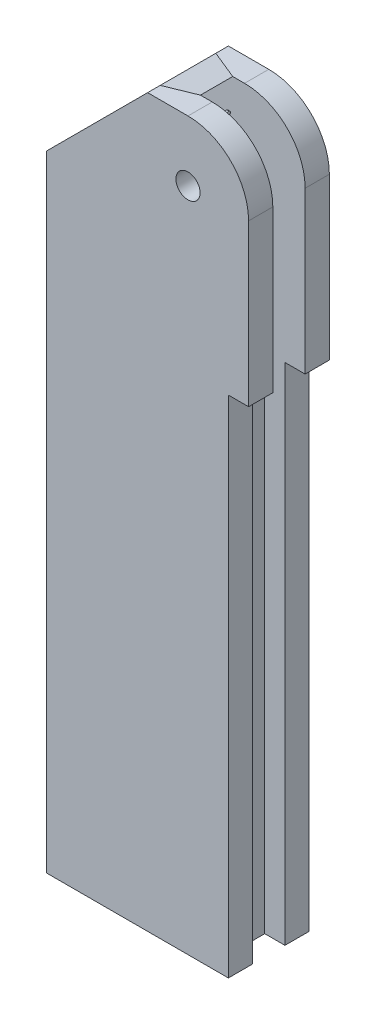
ISO-10303-21;
HEADER;
FILE_DESCRIPTION(('STEP AP214'),'2;1');
FILE_NAME('part.step','',(''),(''),'','','');
FILE_SCHEMA(('AUTOMOTIVE_DESIGN { 1 0 10303 214 1 1 1 1 }'));
ENDSEC;
DATA;
#1=APPLICATION_CONTEXT('core data for automotive mechanical design processes');
#2=APPLICATION_PROTOCOL_DEFINITION('international standard','automotive_design',2000,#1);
#3=PRODUCT_CONTEXT('',#1,'mechanical');
#4=PRODUCT('Part','Part','',(#3));
#5=PRODUCT_RELATED_PRODUCT_CATEGORY('part','',(#4));
#6=PRODUCT_DEFINITION_FORMATION('','',#4);
#7=PRODUCT_DEFINITION_CONTEXT('part definition',#1,'design');
#8=PRODUCT_DEFINITION('design','',#6,#7);
#9=PRODUCT_DEFINITION_SHAPE('','',#8);
#10=(LENGTH_UNIT() NAMED_UNIT(*) SI_UNIT(.MILLI.,.METRE.));
#11=(NAMED_UNIT(*) PLANE_ANGLE_UNIT() SI_UNIT($,.RADIAN.));
#12=(NAMED_UNIT(*) SI_UNIT($,.STERADIAN.) SOLID_ANGLE_UNIT());
#13=UNCERTAINTY_MEASURE_WITH_UNIT(LENGTH_MEASURE(1.E-05),#10,'distance_accuracy_value','');
#14=(GEOMETRIC_REPRESENTATION_CONTEXT(3) GLOBAL_UNCERTAINTY_ASSIGNED_CONTEXT((#13)) GLOBAL_UNIT_ASSIGNED_CONTEXT((#10,
#11,#12)) REPRESENTATION_CONTEXT('',''));
#15=CARTESIAN_POINT('',(0.,0.,0.));
#16=DIRECTION('',(0.,0.,1.));
#17=DIRECTION('',(1.,0.,0.));
#18=AXIS2_PLACEMENT_3D('',#15,#16,#17);
#19=CARTESIAN_POINT('',(-0.5,10.5,0.));
#20=DIRECTION('',(1.,0.,0.));
#21=DIRECTION('',(0.,0.,-1.));
#22=AXIS2_PLACEMENT_3D('',#19,#20,#21);
#23=CYLINDRICAL_SURFACE('',#22,0.5);
#24=CARTESIAN_POINT('',(-0.5,10.5,0.));
#25=DIRECTION('',(1.,0.,0.));
#26=DIRECTION('',(0.,0.,-1.));
#27=AXIS2_PLACEMENT_3D('',#24,#25,#26);
#28=CIRCLE('',#27,0.5);
#29=CARTESIAN_POINT('',(-0.5,10.5,-0.5));
#30=VERTEX_POINT('',#29);
#31=EDGE_CURVE('E11',#30,#30,#28,.T.);
#32=ORIENTED_EDGE('',*,*,#31,.T.);
#33=EDGE_LOOP('',(#32));
#34=FACE_BOUND('',#33,.T.);
#35=CARTESIAN_POINT('',(0.,10.5,0.));
#36=DIRECTION('',(1.,0.,0.));
#37=DIRECTION('',(0.,0.,-1.));
#38=AXIS2_PLACEMENT_3D('',#35,#36,#37);
#39=CIRCLE('',#38,0.5);
#40=CARTESIAN_POINT('',(0.,10.5,-0.5));
#41=VERTEX_POINT('',#40);
#42=EDGE_CURVE('E49',#41,#41,#39,.T.);
#43=ORIENTED_EDGE('',*,*,#42,.F.);
#44=EDGE_LOOP('',(#43));
#45=FACE_BOUND('',#44,.T.);
#46=ADVANCED_FACE('F43',(#34,#45),#23,.T.);
#47=CARTESIAN_POINT('',(-0.5,10.5,0.));
#48=DIRECTION('',(1.,0.,0.));
#49=DIRECTION('',(0.,0.,-1.));
#50=AXIS2_PLACEMENT_3D('',#47,#48,#49);
#51=PLANE('',#50);
#52=ORIENTED_EDGE('',*,*,#31,.F.);
#53=EDGE_LOOP('',(#52));
#54=FACE_BOUND('',#53,.T.);
#55=ADVANCED_FACE('F61',(#54),#51,.F.);
#56=CARTESIAN_POINT('',(0.,10.5,0.));
#57=DIRECTION('',(1.,0.,0.));
#58=DIRECTION('',(0.,0.,-1.));
#59=AXIS2_PLACEMENT_3D('',#56,#57,#58);
#60=PLANE('',#59);
#61=ORIENTED_EDGE('',*,*,#42,.T.);
#62=EDGE_LOOP('',(#61));
#63=FACE_BOUND('',#62,.T.);
#64=ADVANCED_FACE('F58',(#63),#60,.T.);
#65=CLOSED_SHELL('',(#46,#55,#64));
#66=MANIFOLD_SOLID_BREP('B2',#65);
#67=CARTESIAN_POINT('',(10.,-39.85,10.));
#68=DIRECTION('',(-1.,0.,0.));
#69=DIRECTION('',(0.,-1.,0.));
#70=AXIS2_PLACEMENT_3D('',#67,#68,#69);
#71=PLANE('',#70);
#72=DIRECTION('',(0.,0.,-1.));
#73=VECTOR('',#72,1.);
#74=CARTESIAN_POINT('',(10.,-39.85,10.));
#75=LINE('',#74,#73);
#76=CARTESIAN_POINT('',(10.,-39.85,-4.));
#77=VERTEX_POINT('',#76);
#78=CARTESIAN_POINT('',(10.,-39.85,-10.));
#79=VERTEX_POINT('',#78);
#80=EDGE_CURVE('E332',#77,#79,#75,.T.);
#81=ORIENTED_EDGE('',*,*,#80,.F.);
#82=DIRECTION('',(0.,-1.,0.));
#83=VECTOR('',#82,1.);
#84=CARTESIAN_POINT('',(10.,-39.85,-4.));
#85=LINE('',#84,#83);
#86=CARTESIAN_POINT('',(10.,-164.85,-4.));
#87=VERTEX_POINT('',#86);
#88=EDGE_CURVE('E396',#77,#87,#85,.T.);
#89=ORIENTED_EDGE('',*,*,#88,.T.);
#90=DIRECTION('',(0.,0.,-1.));
#91=VECTOR('',#90,1.);
#92=CARTESIAN_POINT('',(10.,-164.85,10.));
#93=LINE('',#92,#91);
#94=CARTESIAN_POINT('',(10.,-164.85,-10.));
#95=VERTEX_POINT('',#94);
#96=EDGE_CURVE('E336',#87,#95,#93,.T.);
#97=ORIENTED_EDGE('',*,*,#96,.T.);
#98=DIRECTION('',(0.,1.,0.));
#99=VECTOR('',#98,1.);
#100=CARTESIAN_POINT('',(10.,-39.85,-10.));
#101=LINE('',#100,#99);
#102=EDGE_CURVE('E272',#95,#79,#101,.T.);
#103=ORIENTED_EDGE('',*,*,#102,.T.);
#104=EDGE_LOOP('',(#81,#89,#97,#103));
#105=FACE_BOUND('',#104,.T.);
#106=ADVANCED_FACE('F88',(#105),#71,.F.);
#107=CARTESIAN_POINT('',(15.,-39.85,10.));
#108=DIRECTION('',(0.,1.,0.));
#109=DIRECTION('',(0.,0.,1.));
#110=AXIS2_PLACEMENT_3D('',#107,#108,#109);
#111=PLANE('',#110);
#112=DIRECTION('',(0.,0.,-1.));
#113=VECTOR('',#112,1.);
#114=CARTESIAN_POINT('',(15.,-39.85,10.));
#115=LINE('',#114,#113);
#116=CARTESIAN_POINT('',(15.,-39.85,-4.));
#117=VERTEX_POINT('',#116);
#118=CARTESIAN_POINT('',(15.,-39.85,-10.));
#119=VERTEX_POINT('',#118);
#120=EDGE_CURVE('E328',#117,#119,#115,.T.);
#121=ORIENTED_EDGE('',*,*,#120,.F.);
#122=DIRECTION('',(-1.,0.,0.));
#123=VECTOR('',#122,1.);
#124=CARTESIAN_POINT('',(15.,-39.85,-4.));
#125=LINE('',#124,#123);
#126=EDGE_CURVE('E399',#117,#77,#125,.T.);
#127=ORIENTED_EDGE('',*,*,#126,.T.);
#128=ORIENTED_EDGE('',*,*,#80,.T.);
#129=DIRECTION('',(1.,0.,0.));
#130=VECTOR('',#129,1.);
#131=CARTESIAN_POINT('',(15.,-39.85,-10.));
#132=LINE('',#131,#130);
#133=EDGE_CURVE('E275',#79,#119,#132,.T.);
#134=ORIENTED_EDGE('',*,*,#133,.T.);
#135=EDGE_LOOP('',(#121,#127,#128,#134));
#136=FACE_BOUND('',#135,.T.);
#137=ADVANCED_FACE('F425',(#136),#111,.F.);
#138=CARTESIAN_POINT('',(15.,0.,10.));
#139=DIRECTION('',(-1.,0.,0.));
#140=DIRECTION('',(0.,-1.,0.));
#141=AXIS2_PLACEMENT_3D('',#138,#139,#140);
#142=PLANE('',#141);
#143=DIRECTION('',(0.,1.,0.));
#144=VECTOR('',#143,1.);
#145=CARTESIAN_POINT('',(15.,-15.,-4.));
#146=LINE('',#145,#144);
#147=CARTESIAN_POINT('',(15.,0.,-4.));
#148=VERTEX_POINT('',#147);
#149=EDGE_CURVE('E395',#117,#148,#146,.T.);
#150=ORIENTED_EDGE('',*,*,#149,.F.);
#151=ORIENTED_EDGE('',*,*,#120,.T.);
#152=DIRECTION('',(0.,1.,0.));
#153=VECTOR('',#152,1.);
#154=CARTESIAN_POINT('',(15.,0.,-10.));
#155=LINE('',#154,#153);
#156=CARTESIAN_POINT('',(15.,0.,-10.));
#157=VERTEX_POINT('',#156);
#158=EDGE_CURVE('E278',#119,#157,#155,.T.);
#159=ORIENTED_EDGE('',*,*,#158,.T.);
#160=DIRECTION('',(0.,0.,-1.));
#161=VECTOR('',#160,1.);
#162=CARTESIAN_POINT('',(15.,0.,10.));
#163=LINE('',#162,#161);
#164=EDGE_CURVE('E324',#148,#157,#163,.T.);
#165=ORIENTED_EDGE('',*,*,#164,.F.);
#166=EDGE_LOOP('',(#150,#151,#159,#165));
#167=FACE_BOUND('',#166,.T.);
#168=ADVANCED_FACE('F435',(#167),#142,.F.);
#169=CARTESIAN_POINT('',(0.,0.,10.));
#170=DIRECTION('',(0.,0.,-1.));
#171=DIRECTION('',(-1.,0.,0.));
#172=AXIS2_PLACEMENT_3D('',#169,#170,#171);
#173=CYLINDRICAL_SURFACE('',#172,15.);
#174=CARTESIAN_POINT('',(15.,0.,10.));
#175=VERTEX_POINT('',#174);
#176=CARTESIAN_POINT('',(15.,0.,4.));
#177=VERTEX_POINT('',#176);
#178=EDGE_CURVE('E325',#175,#177,#163,.T.);
#179=ORIENTED_EDGE('',*,*,#178,.T.);
#180=CARTESIAN_POINT('',(0.,0.,4.));
#181=DIRECTION('',(0.,0.,1.));
#182=DIRECTION('',(1.,0.,0.));
#183=AXIS2_PLACEMENT_3D('',#180,#181,#182);
#184=CIRCLE('',#183,15.);
#185=CARTESIAN_POINT('',(0.,15.,4.));
#186=VERTEX_POINT('',#185);
#187=EDGE_CURVE('E260',#177,#186,#184,.T.);
#188=ORIENTED_EDGE('',*,*,#187,.T.);
#189=DIRECTION('',(0.,0.,-1.));
#190=VECTOR('',#189,1.);
#191=CARTESIAN_POINT('',(0.,15.,10.));
#192=LINE('',#191,#190);
#193=CARTESIAN_POINT('',(0.,15.,10.));
#194=VERTEX_POINT('',#193);
#195=EDGE_CURVE('E320',#194,#186,#192,.T.);
#196=ORIENTED_EDGE('',*,*,#195,.F.);
#197=CARTESIAN_POINT('',(0.,0.,10.));
#198=DIRECTION('',(0.,0.,1.));
#199=DIRECTION('',(-1.,0.,0.));
#200=AXIS2_PLACEMENT_3D('',#197,#198,#199);
#201=CIRCLE('',#200,15.);
#202=EDGE_CURVE('E304',#175,#194,#201,.T.);
#203=ORIENTED_EDGE('',*,*,#202,.F.);
#204=EDGE_LOOP('',(#179,#188,#196,#203));
#205=FACE_BOUND('',#204,.T.);
#206=ADVANCED_FACE('F386',(#205),#173,.T.);
#207=CARTESIAN_POINT('',(-10.,15.,10.));
#208=DIRECTION('',(0.,-1.,0.));
#209=DIRECTION('',(1.,0.,0.));
#210=AXIS2_PLACEMENT_3D('',#207,#208,#209);
#211=PLANE('',#210);
#212=DIRECTION('',(-1.,0.,0.));
#213=VECTOR('',#212,1.);
#214=CARTESIAN_POINT('',(-10.,15.,4.));
#215=LINE('',#214,#213);
#216=CARTESIAN_POINT('',(-2.92893218813455,15.,4.));
#217=VERTEX_POINT('',#216);
#218=EDGE_CURVE('E257',#186,#217,#215,.T.);
#219=ORIENTED_EDGE('',*,*,#218,.T.);
#220=DIRECTION('',(0.925820099772552,0.,-0.377964473009226));
#221=VECTOR('',#220,1.);
#222=CARTESIAN_POINT('',(-31.4285714285714,15.,15.6349289987451));
#223=LINE('',#222,#221);
#224=CARTESIAN_POINT('',(-10.,15.,6.88675134594811));
#225=VERTEX_POINT('',#224);
#226=EDGE_CURVE('E354',#217,#225,#223,.F.);
#227=ORIENTED_EDGE('',*,*,#226,.T.);
#228=DIRECTION('',(0.,0.,-1.));
#229=VECTOR('',#228,1.);
#230=CARTESIAN_POINT('',(-10.,15.,10.));
#231=LINE('',#230,#229);
#232=CARTESIAN_POINT('',(-10.,15.,10.));
#233=VERTEX_POINT('',#232);
#234=EDGE_CURVE('E316',#233,#225,#231,.T.);
#235=ORIENTED_EDGE('',*,*,#234,.F.);
#236=DIRECTION('',(-1.,0.,0.));
#237=VECTOR('',#236,1.);
#238=CARTESIAN_POINT('',(-10.,15.,10.));
#239=LINE('',#238,#237);
#240=EDGE_CURVE('E306',#194,#233,#239,.T.);
#241=ORIENTED_EDGE('',*,*,#240,.F.);
#242=ORIENTED_EDGE('',*,*,#195,.T.);
#243=EDGE_LOOP('',(#219,#227,#235,#241,#242));
#244=FACE_BOUND('',#243,.T.);
#245=ADVANCED_FACE('F372',(#244),#211,.F.);
#246=CARTESIAN_POINT('',(-35.,-10.0000000000001,10.));
#247=DIRECTION('',(0.707106781186549,-0.707106781186546,0.));
#248=DIRECTION('',(0.707106781186546,0.707106781186549,0.));
#249=AXIS2_PLACEMENT_3D('',#246,#247,#248);
#250=PLANE('',#249);
#251=ORIENTED_EDGE('',*,*,#234,.T.);
#252=DIRECTION('',(-0.707106781186546,-0.707106781186549,0.));
#253=VECTOR('',#252,1.);
#254=CARTESIAN_POINT('',(-35.,-10.0000000000001,6.88675134594811));
#255=LINE('',#254,#253);
#256=CARTESIAN_POINT('',(-35.,-10.0000000000001,6.88675134594811));
#257=VERTEX_POINT('',#256);
#258=EDGE_CURVE('E341',#225,#257,#255,.T.);
#259=ORIENTED_EDGE('',*,*,#258,.T.);
#260=DIRECTION('',(0.,0.,-1.));
#261=VECTOR('',#260,1.);
#262=CARTESIAN_POINT('',(-35.,-10.0000000000001,10.));
#263=LINE('',#262,#261);
#264=CARTESIAN_POINT('',(-35.,-10.0000000000001,10.));
#265=VERTEX_POINT('',#264);
#266=EDGE_CURVE('E312',#265,#257,#263,.T.);
#267=ORIENTED_EDGE('',*,*,#266,.F.);
#268=DIRECTION('',(-0.707106781186546,-0.707106781186549,0.));
#269=VECTOR('',#268,1.);
#270=CARTESIAN_POINT('',(-35.,-10.0000000000001,10.));
#271=LINE('',#270,#269);
#272=EDGE_CURVE('E309',#233,#265,#271,.T.);
#273=ORIENTED_EDGE('',*,*,#272,.F.);
#274=EDGE_LOOP('',(#251,#259,#267,#273));
#275=FACE_BOUND('',#274,.T.);
#276=ADVANCED_FACE('F376',(#275),#250,.F.);
#277=CARTESIAN_POINT('',(0.,0.,10.));
#278=DIRECTION('',(0.,0.,-1.));
#279=DIRECTION('',(-1.,0.,0.));
#280=AXIS2_PLACEMENT_3D('',#277,#278,#279);
#281=CYLINDRICAL_SURFACE('',#280,3.);
#282=CARTESIAN_POINT('',(0.,0.,4.));
#283=DIRECTION('',(0.,0.,1.));
#284=DIRECTION('',(1.,0.,0.));
#285=AXIS2_PLACEMENT_3D('',#282,#283,#284);
#286=CIRCLE('',#285,3.);
#287=CARTESIAN_POINT('',(3.,0.,4.));
#288=VERTEX_POINT('',#287);
#289=EDGE_CURVE('E256',#288,#288,#286,.T.);
#290=ORIENTED_EDGE('',*,*,#289,.F.);
#291=EDGE_LOOP('',(#290));
#292=FACE_BOUND('',#291,.T.);
#293=CARTESIAN_POINT('',(0.,0.,10.));
#294=DIRECTION('',(0.,0.,1.));
#295=DIRECTION('',(1.,0.,0.));
#296=AXIS2_PLACEMENT_3D('',#293,#294,#295);
#297=CIRCLE('',#296,3.);
#298=CARTESIAN_POINT('',(3.,0.,10.));
#299=VERTEX_POINT('',#298);
#300=EDGE_CURVE('E290',#299,#299,#297,.T.);
#301=ORIENTED_EDGE('',*,*,#300,.T.);
#302=EDGE_LOOP('',(#301));
#303=FACE_BOUND('',#302,.T.);
#304=ADVANCED_FACE('F478',(#292,#303),#281,.F.);
#305=CARTESIAN_POINT('',(0.,0.,10.));
#306=DIRECTION('',(0.,0.,-1.));
#307=DIRECTION('',(-1.,0.,0.));
#308=AXIS2_PLACEMENT_3D('',#305,#306,#307);
#309=PLANE('',#308);
#310=DIRECTION('',(0.,-1.,0.));
#311=VECTOR('',#310,1.);
#312=CARTESIAN_POINT('',(-35.,-164.85,10.));
#313=LINE('',#312,#311);
#314=CARTESIAN_POINT('',(-35.,-164.85,10.));
#315=VERTEX_POINT('',#314);
#316=EDGE_CURVE('E293',#265,#315,#313,.T.);
#317=ORIENTED_EDGE('',*,*,#316,.T.);
#318=DIRECTION('',(1.,0.,0.));
#319=VECTOR('',#318,1.);
#320=CARTESIAN_POINT('',(10.,-164.85,10.));
#321=LINE('',#320,#319);
#322=CARTESIAN_POINT('',(10.,-164.85,10.));
#323=VERTEX_POINT('',#322);
#324=EDGE_CURVE('E296',#315,#323,#321,.T.);
#325=ORIENTED_EDGE('',*,*,#324,.T.);
#326=DIRECTION('',(0.,1.,0.));
#327=VECTOR('',#326,1.);
#328=CARTESIAN_POINT('',(10.,-39.85,10.));
#329=LINE('',#328,#327);
#330=CARTESIAN_POINT('',(10.,-39.85,10.));
#331=VERTEX_POINT('',#330);
#332=EDGE_CURVE('E298',#323,#331,#329,.T.);
#333=ORIENTED_EDGE('',*,*,#332,.T.);
#334=DIRECTION('',(1.,0.,0.));
#335=VECTOR('',#334,1.);
#336=CARTESIAN_POINT('',(15.,-39.85,10.));
#337=LINE('',#336,#335);
#338=CARTESIAN_POINT('',(15.,-39.85,10.));
#339=VERTEX_POINT('',#338);
#340=EDGE_CURVE('E300',#331,#339,#337,.T.);
#341=ORIENTED_EDGE('',*,*,#340,.T.);
#342=DIRECTION('',(0.,1.,0.));
#343=VECTOR('',#342,1.);
#344=CARTESIAN_POINT('',(15.,0.,10.));
#345=LINE('',#344,#343);
#346=EDGE_CURVE('E302',#339,#175,#345,.T.);
#347=ORIENTED_EDGE('',*,*,#346,.T.);
#348=ORIENTED_EDGE('',*,*,#202,.T.);
#349=ORIENTED_EDGE('',*,*,#240,.T.);
#350=ORIENTED_EDGE('',*,*,#272,.T.);
#351=EDGE_LOOP('',(#317,#325,#333,#341,#347,#348,#349,#350));
#352=FACE_BOUND('',#351,.T.);
#353=ORIENTED_EDGE('',*,*,#300,.F.);
#354=EDGE_LOOP('',(#353));
#355=FACE_BOUND('',#354,.T.);
#356=ADVANCED_FACE('F380',(#352,#355),#309,.F.);
#357=CARTESIAN_POINT('',(-35.,-164.85,10.));
#358=DIRECTION('',(1.,0.,0.));
#359=DIRECTION('',(0.,1.,0.));
#360=AXIS2_PLACEMENT_3D('',#357,#358,#359);
#361=PLANE('',#360);
#362=DIRECTION('',(0.,0.925820099772553,0.377964473009224));
#363=VECTOR('',#362,1.);
#364=CARTESIAN_POINT('',(-35.,-10.0000000000001,6.88675134594811));
#365=LINE('',#364,#363);
#366=CARTESIAN_POINT('',(-35.,-15.,4.84550989362885));
#367=VERTEX_POINT('',#366);
#368=EDGE_CURVE('E349',#257,#367,#365,.F.);
#369=ORIENTED_EDGE('',*,*,#368,.T.);
#370=DIRECTION('',(0.,0.,-1.));
#371=VECTOR('',#370,1.);
#372=CARTESIAN_POINT('',(-35.,-15.,4.));
#373=LINE('',#372,#371);
#374=CARTESIAN_POINT('',(-35.,-15.,-4.84550989362885));
#375=VERTEX_POINT('',#374);
#376=EDGE_CURVE('E247',#367,#375,#373,.T.);
#377=ORIENTED_EDGE('',*,*,#376,.T.);
#378=DIRECTION('',(0.,-0.925820099772553,0.377964473009224));
#379=VECTOR('',#378,1.);
#380=CARTESIAN_POINT('',(-35.,-10.0000000000001,-6.88675134594811));
#381=LINE('',#380,#379);
#382=CARTESIAN_POINT('',(-35.,-10.0000000000001,-6.88675134594811));
#383=VERTEX_POINT('',#382);
#384=EDGE_CURVE('E347',#375,#383,#381,.F.);
#385=ORIENTED_EDGE('',*,*,#384,.T.);
#386=CARTESIAN_POINT('',(-35.,-10.0000000000001,-10.));
#387=VERTEX_POINT('',#386);
#388=EDGE_CURVE('E311',#383,#387,#263,.T.);
#389=ORIENTED_EDGE('',*,*,#388,.T.);
#390=DIRECTION('',(0.,-1.,0.));
#391=VECTOR('',#390,1.);
#392=CARTESIAN_POINT('',(-35.,-164.85,-10.));
#393=LINE('',#392,#391);
#394=CARTESIAN_POINT('',(-35.,-164.85,-10.));
#395=VERTEX_POINT('',#394);
#396=EDGE_CURVE('E266',#387,#395,#393,.T.);
#397=ORIENTED_EDGE('',*,*,#396,.T.);
#398=DIRECTION('',(0.,0.,-1.));
#399=VECTOR('',#398,1.);
#400=CARTESIAN_POINT('',(-35.,-164.85,10.));
#401=LINE('',#400,#399);
#402=EDGE_CURVE('E340',#315,#395,#401,.T.);
#403=ORIENTED_EDGE('',*,*,#402,.F.);
#404=ORIENTED_EDGE('',*,*,#316,.F.);
#405=ORIENTED_EDGE('',*,*,#266,.T.);
#406=EDGE_LOOP('',(#369,#377,#385,#389,#397,#403,#404,#405));
#407=FACE_BOUND('',#406,.T.);
#408=ADVANCED_FACE('F90',(#407),#361,.F.);
#409=CARTESIAN_POINT('',(10.,-164.85,10.));
#410=DIRECTION('',(0.,1.,0.));
#411=DIRECTION('',(0.,0.,1.));
#412=AXIS2_PLACEMENT_3D('',#409,#410,#411);
#413=PLANE('',#412);
#414=ORIENTED_EDGE('',*,*,#96,.F.);
#415=DIRECTION('',(-1.,0.,0.));
#416=VECTOR('',#415,1.);
#417=CARTESIAN_POINT('',(5.00000000000001,-164.85,-4.));
#418=LINE('',#417,#416);
#419=CARTESIAN_POINT('',(5.00000000000001,-164.85,-4.));
#420=VERTEX_POINT('',#419);
#421=EDGE_CURVE('E408',#87,#420,#418,.T.);
#422=ORIENTED_EDGE('',*,*,#421,.T.);
#423=DIRECTION('',(0.,0.,1.));
#424=VECTOR('',#423,1.);
#425=CARTESIAN_POINT('',(5.00000000000001,-164.85,4.));
#426=LINE('',#425,#424);
#427=CARTESIAN_POINT('',(5.00000000000001,-164.85,4.));
#428=VERTEX_POINT('',#427);
#429=EDGE_CURVE('E228',#420,#428,#426,.T.);
#430=ORIENTED_EDGE('',*,*,#429,.T.);
#431=DIRECTION('',(1.,0.,0.));
#432=VECTOR('',#431,1.);
#433=CARTESIAN_POINT('',(5.00000000000001,-164.85,4.));
#434=LINE('',#433,#432);
#435=CARTESIAN_POINT('',(10.,-164.85,4.));
#436=VERTEX_POINT('',#435);
#437=EDGE_CURVE('E411',#428,#436,#434,.T.);
#438=ORIENTED_EDGE('',*,*,#437,.T.);
#439=EDGE_CURVE('E337',#323,#436,#93,.T.);
#440=ORIENTED_EDGE('',*,*,#439,.F.);
#441=ORIENTED_EDGE('',*,*,#324,.F.);
#442=ORIENTED_EDGE('',*,*,#402,.T.);
#443=DIRECTION('',(1.,0.,0.));
#444=VECTOR('',#443,1.);
#445=CARTESIAN_POINT('',(10.,-164.85,-10.));
#446=LINE('',#445,#444);
#447=EDGE_CURVE('E269',#395,#95,#446,.T.);
#448=ORIENTED_EDGE('',*,*,#447,.T.);
#449=EDGE_LOOP('',(#414,#422,#430,#438,#440,#441,#442,#448));
#450=FACE_BOUND('',#449,.T.);
#451=ADVANCED_FACE('F416',(#450),#413,.F.);
#452=ORIENTED_EDGE('',*,*,#439,.T.);
#453=DIRECTION('',(0.,1.,0.));
#454=VECTOR('',#453,1.);
#455=CARTESIAN_POINT('',(10.,-39.85,4.));
#456=LINE('',#455,#454);
#457=CARTESIAN_POINT('',(10.,-39.85,4.));
#458=VERTEX_POINT('',#457);
#459=EDGE_CURVE('E404',#436,#458,#456,.T.);
#460=ORIENTED_EDGE('',*,*,#459,.T.);
#461=EDGE_CURVE('E333',#331,#458,#75,.T.);
#462=ORIENTED_EDGE('',*,*,#461,.F.);
#463=ORIENTED_EDGE('',*,*,#332,.F.);
#464=EDGE_LOOP('',(#452,#460,#462,#463));
#465=FACE_BOUND('',#464,.T.);
#466=ADVANCED_FACE('F456',(#465),#71,.F.);
#467=ORIENTED_EDGE('',*,*,#461,.T.);
#468=DIRECTION('',(1.,0.,0.));
#469=VECTOR('',#468,1.);
#470=CARTESIAN_POINT('',(15.,-39.85,4.));
#471=LINE('',#470,#469);
#472=CARTESIAN_POINT('',(15.,-39.85,4.));
#473=VERTEX_POINT('',#472);
#474=EDGE_CURVE('E230',#458,#473,#471,.T.);
#475=ORIENTED_EDGE('',*,*,#474,.T.);
#476=EDGE_CURVE('E329',#339,#473,#115,.T.);
#477=ORIENTED_EDGE('',*,*,#476,.F.);
#478=ORIENTED_EDGE('',*,*,#340,.F.);
#479=EDGE_LOOP('',(#467,#475,#477,#478));
#480=FACE_BOUND('',#479,.T.);
#481=ADVANCED_FACE('F458',(#480),#111,.F.);
#482=ORIENTED_EDGE('',*,*,#476,.T.);
#483=DIRECTION('',(0.,-1.,0.));
#484=VECTOR('',#483,1.);
#485=CARTESIAN_POINT('',(15.,-15.,4.));
#486=LINE('',#485,#484);
#487=EDGE_CURVE('E389',#177,#473,#486,.T.);
#488=ORIENTED_EDGE('',*,*,#487,.F.);
#489=ORIENTED_EDGE('',*,*,#178,.F.);
#490=ORIENTED_EDGE('',*,*,#346,.F.);
#491=EDGE_LOOP('',(#482,#488,#489,#490));
#492=FACE_BOUND('',#491,.T.);
#493=ADVANCED_FACE('F392',(#492),#142,.F.);
#494=CARTESIAN_POINT('',(0.,15.,-4.));
#495=VERTEX_POINT('',#494);
#496=CARTESIAN_POINT('',(0.,15.,-10.));
#497=VERTEX_POINT('',#496);
#498=EDGE_CURVE('E319',#495,#497,#192,.T.);
#499=ORIENTED_EDGE('',*,*,#498,.F.);
#500=CARTESIAN_POINT('',(0.,0.,-4.));
#501=DIRECTION('',(0.,0.,-1.));
#502=DIRECTION('',(-1.,0.,0.));
#503=AXIS2_PLACEMENT_3D('',#500,#501,#502);
#504=CIRCLE('',#503,15.);
#505=EDGE_CURVE('E253',#495,#148,#504,.T.);
#506=ORIENTED_EDGE('',*,*,#505,.T.);
#507=ORIENTED_EDGE('',*,*,#164,.T.);
#508=CARTESIAN_POINT('',(0.,0.,-10.));
#509=DIRECTION('',(0.,0.,1.));
#510=DIRECTION('',(-1.,0.,0.));
#511=AXIS2_PLACEMENT_3D('',#508,#509,#510);
#512=CIRCLE('',#511,15.);
#513=EDGE_CURVE('E281',#157,#497,#512,.T.);
#514=ORIENTED_EDGE('',*,*,#513,.T.);
#515=EDGE_LOOP('',(#499,#506,#507,#514));
#516=FACE_BOUND('',#515,.T.);
#517=ADVANCED_FACE('F439',(#516),#173,.T.);
#518=CARTESIAN_POINT('',(-10.,15.,-6.8867513459481));
#519=VERTEX_POINT('',#518);
#520=CARTESIAN_POINT('',(-10.,15.,-10.));
#521=VERTEX_POINT('',#520);
#522=EDGE_CURVE('E315',#519,#521,#231,.T.);
#523=ORIENTED_EDGE('',*,*,#522,.F.);
#524=DIRECTION('',(-0.925820099772552,0.,-0.377964473009226));
#525=VECTOR('',#524,1.);
#526=CARTESIAN_POINT('',(-31.4285714285714,15.,-15.6349289987451));
#527=LINE('',#526,#525);
#528=CARTESIAN_POINT('',(-2.92893218813454,15.,-4.));
#529=VERTEX_POINT('',#528);
#530=EDGE_CURVE('E359',#519,#529,#527,.F.);
#531=ORIENTED_EDGE('',*,*,#530,.T.);
#532=DIRECTION('',(1.,0.,0.));
#533=VECTOR('',#532,1.);
#534=CARTESIAN_POINT('',(-10.,15.,-4.));
#535=LINE('',#534,#533);
#536=EDGE_CURVE('E245',#529,#495,#535,.T.);
#537=ORIENTED_EDGE('',*,*,#536,.T.);
#538=ORIENTED_EDGE('',*,*,#498,.T.);
#539=DIRECTION('',(-1.,0.,0.));
#540=VECTOR('',#539,1.);
#541=CARTESIAN_POINT('',(-10.,15.,-10.));
#542=LINE('',#541,#540);
#543=EDGE_CURVE('E284',#497,#521,#542,.T.);
#544=ORIENTED_EDGE('',*,*,#543,.T.);
#545=EDGE_LOOP('',(#523,#531,#537,#538,#544));
#546=FACE_BOUND('',#545,.T.);
#547=ADVANCED_FACE('F442',(#546),#211,.F.);
#548=ORIENTED_EDGE('',*,*,#388,.F.);
#549=DIRECTION('',(0.707106781186546,0.707106781186549,0.));
#550=VECTOR('',#549,1.);
#551=CARTESIAN_POINT('',(-35.,-10.0000000000001,-6.88675134594811));
#552=LINE('',#551,#550);
#553=EDGE_CURVE('E356',#383,#519,#552,.T.);
#554=ORIENTED_EDGE('',*,*,#553,.T.);
#555=ORIENTED_EDGE('',*,*,#522,.T.);
#556=DIRECTION('',(-0.707106781186546,-0.707106781186549,0.));
#557=VECTOR('',#556,1.);
#558=CARTESIAN_POINT('',(-35.,-10.0000000000001,-10.));
#559=LINE('',#558,#557);
#560=EDGE_CURVE('E287',#521,#387,#559,.T.);
#561=ORIENTED_EDGE('',*,*,#560,.T.);
#562=EDGE_LOOP('',(#548,#554,#555,#561));
#563=FACE_BOUND('',#562,.T.);
#564=ADVANCED_FACE('F446',(#563),#250,.F.);
#565=CARTESIAN_POINT('',(0.,0.,-4.));
#566=DIRECTION('',(0.,0.,-1.));
#567=DIRECTION('',(-1.,0.,0.));
#568=AXIS2_PLACEMENT_3D('',#565,#566,#567);
#569=CIRCLE('',#568,3.);
#570=CARTESIAN_POINT('',(-3.,0.,-4.));
#571=VERTEX_POINT('',#570);
#572=EDGE_CURVE('E242',#571,#571,#569,.T.);
#573=ORIENTED_EDGE('',*,*,#572,.F.);
#574=EDGE_LOOP('',(#573));
#575=FACE_BOUND('',#574,.T.);
#576=CARTESIAN_POINT('',(0.,0.,-10.));
#577=DIRECTION('',(0.,0.,1.));
#578=DIRECTION('',(1.,0.,0.));
#579=AXIS2_PLACEMENT_3D('',#576,#577,#578);
#580=CIRCLE('',#579,3.);
#581=CARTESIAN_POINT('',(3.,0.,-10.));
#582=VERTEX_POINT('',#581);
#583=EDGE_CURVE('E263',#582,#582,#580,.T.);
#584=ORIENTED_EDGE('',*,*,#583,.F.);
#585=EDGE_LOOP('',(#584));
#586=FACE_BOUND('',#585,.T.);
#587=ADVANCED_FACE('F485',(#575,#586),#281,.F.);
#588=CARTESIAN_POINT('',(0.,0.,-10.));
#589=DIRECTION('',(0.,0.,-1.));
#590=DIRECTION('',(-1.,0.,0.));
#591=AXIS2_PLACEMENT_3D('',#588,#589,#590);
#592=PLANE('',#591);
#593=ORIENTED_EDGE('',*,*,#583,.T.);
#594=EDGE_LOOP('',(#593));
#595=FACE_BOUND('',#594,.T.);
#596=ORIENTED_EDGE('',*,*,#396,.F.);
#597=ORIENTED_EDGE('',*,*,#560,.F.);
#598=ORIENTED_EDGE('',*,*,#543,.F.);
#599=ORIENTED_EDGE('',*,*,#513,.F.);
#600=ORIENTED_EDGE('',*,*,#158,.F.);
#601=ORIENTED_EDGE('',*,*,#133,.F.);
#602=ORIENTED_EDGE('',*,*,#102,.F.);
#603=ORIENTED_EDGE('',*,*,#447,.F.);
#604=EDGE_LOOP('',(#596,#597,#598,#599,#600,#601,#602,#603));
#605=FACE_BOUND('',#604,.T.);
#606=ADVANCED_FACE('F429',(#595,#605),#592,.T.);
#607=CARTESIAN_POINT('',(-35.,-15.,4.));
#608=DIRECTION('',(0.,0.,1.));
#609=DIRECTION('',(1.,0.,0.));
#610=AXIS2_PLACEMENT_3D('',#607,#608,#609);
#611=PLANE('',#610);
#612=ORIENTED_EDGE('',*,*,#289,.T.);
#613=EDGE_LOOP('',(#612));
#614=FACE_BOUND('',#613,.T.);
#615=DIRECTION('',(1.,0.,0.));
#616=VECTOR('',#615,1.);
#617=CARTESIAN_POINT('',(-35.,-15.,4.));
#618=LINE('',#617,#616);
#619=CARTESIAN_POINT('',(-32.9289321881344,-15.,4.));
#620=VERTEX_POINT('',#619);
#621=CARTESIAN_POINT('',(5.,-15.,4.));
#622=VERTEX_POINT('',#621);
#623=EDGE_CURVE('E239',#620,#622,#618,.T.);
#624=ORIENTED_EDGE('',*,*,#623,.F.);
#625=DIRECTION('',(0.707106781186546,0.707106781186549,0.));
#626=VECTOR('',#625,1.);
#627=CARTESIAN_POINT('',(-33.9644660940672,-16.0355339059328,4.));
#628=LINE('',#627,#626);
#629=EDGE_CURVE('E352',#620,#217,#628,.T.);
#630=ORIENTED_EDGE('',*,*,#629,.T.);
#631=ORIENTED_EDGE('',*,*,#218,.F.);
#632=ORIENTED_EDGE('',*,*,#187,.F.);
#633=ORIENTED_EDGE('',*,*,#487,.T.);
#634=ORIENTED_EDGE('',*,*,#474,.F.);
#635=ORIENTED_EDGE('',*,*,#459,.F.);
#636=ORIENTED_EDGE('',*,*,#437,.F.);
#637=DIRECTION('',(0.,1.,0.));
#638=VECTOR('',#637,1.);
#639=CARTESIAN_POINT('',(5.00000000000001,-164.85,4.));
#640=LINE('',#639,#638);
#641=EDGE_CURVE('E231',#428,#622,#640,.T.);
#642=ORIENTED_EDGE('',*,*,#641,.T.);
#643=EDGE_LOOP('',(#624,#630,#631,#632,#633,#634,#635,#636,#642));
#644=FACE_BOUND('',#643,.T.);
#645=ADVANCED_FACE('F365',(#614,#644),#611,.F.);
#646=CARTESIAN_POINT('',(-35.,-15.,-4.));
#647=DIRECTION('',(0.,0.,-1.));
#648=DIRECTION('',(-1.,0.,0.));
#649=AXIS2_PLACEMENT_3D('',#646,#647,#648);
#650=PLANE('',#649);
#651=ORIENTED_EDGE('',*,*,#572,.T.);
#652=EDGE_LOOP('',(#651));
#653=FACE_BOUND('',#652,.T.);
#654=ORIENTED_EDGE('',*,*,#536,.F.);
#655=DIRECTION('',(-0.707106781186546,-0.707106781186549,0.));
#656=VECTOR('',#655,1.);
#657=CARTESIAN_POINT('',(-33.9644660940672,-16.0355339059328,-4.));
#658=LINE('',#657,#656);
#659=CARTESIAN_POINT('',(-32.9289321881344,-15.,-4.));
#660=VERTEX_POINT('',#659);
#661=EDGE_CURVE('E111',#529,#660,#658,.T.);
#662=ORIENTED_EDGE('',*,*,#661,.T.);
#663=DIRECTION('',(1.,0.,0.));
#664=VECTOR('',#663,1.);
#665=CARTESIAN_POINT('',(-35.,-15.,-4.));
#666=LINE('',#665,#664);
#667=CARTESIAN_POINT('',(5.,-15.,-4.));
#668=VERTEX_POINT('',#667);
#669=EDGE_CURVE('E236',#660,#668,#666,.T.);
#670=ORIENTED_EDGE('',*,*,#669,.T.);
#671=DIRECTION('',(0.,1.,0.));
#672=VECTOR('',#671,1.);
#673=CARTESIAN_POINT('',(5.00000000000001,-164.85,-4.));
#674=LINE('',#673,#672);
#675=EDGE_CURVE('E225',#420,#668,#674,.T.);
#676=ORIENTED_EDGE('',*,*,#675,.F.);
#677=ORIENTED_EDGE('',*,*,#421,.F.);
#678=ORIENTED_EDGE('',*,*,#88,.F.);
#679=ORIENTED_EDGE('',*,*,#126,.F.);
#680=ORIENTED_EDGE('',*,*,#149,.T.);
#681=ORIENTED_EDGE('',*,*,#505,.F.);
#682=EDGE_LOOP('',(#654,#662,#670,#676,#677,#678,#679,#680,#681));
#683=FACE_BOUND('',#682,.T.);
#684=ADVANCED_FACE('F241',(#653,#683),#650,.F.);
#685=CARTESIAN_POINT('',(-35.,-15.,4.));
#686=DIRECTION('',(0.,-1.,0.));
#687=DIRECTION('',(1.,0.,0.));
#688=AXIS2_PLACEMENT_3D('',#685,#686,#687);
#689=PLANE('',#688);
#690=ORIENTED_EDGE('',*,*,#623,.T.);
#691=DIRECTION('',(0.,0.,1.));
#692=VECTOR('',#691,1.);
#693=CARTESIAN_POINT('',(5.,-15.,4.));
#694=LINE('',#693,#692);
#695=EDGE_CURVE('E103',#668,#622,#694,.T.);
#696=ORIENTED_EDGE('',*,*,#695,.F.);
#697=ORIENTED_EDGE('',*,*,#669,.F.);
#698=DIRECTION('',(0.925820099772552,0.,0.377964473009225));
#699=VECTOR('',#698,1.);
#700=CARTESIAN_POINT('',(-31.9047163208384,-15.,-3.58186562311046));
#701=LINE('',#700,#699);
#702=EDGE_CURVE('E41',#660,#375,#701,.F.);
#703=ORIENTED_EDGE('',*,*,#702,.T.);
#704=ORIENTED_EDGE('',*,*,#376,.F.);
#705=DIRECTION('',(-0.925820099772552,0.,0.377964473009226));
#706=VECTOR('',#705,1.);
#707=CARTESIAN_POINT('',(-34.7041331697335,-15.,4.72472276596759));
#708=LINE('',#707,#706);
#709=EDGE_CURVE('E96',#367,#620,#708,.F.);
#710=ORIENTED_EDGE('',*,*,#709,.T.);
#711=EDGE_LOOP('',(#690,#696,#697,#703,#704,#710));
#712=FACE_BOUND('',#711,.T.);
#713=ADVANCED_FACE('F235',(#712),#689,.F.);
#714=CARTESIAN_POINT('',(-35.,-10.0000000000001,6.88675134594811));
#715=DIRECTION('',(0.353553390593273,-0.353553390593271,0.86602540378444));
#716=DIRECTION('',(0.925820099772552,0.,-0.377964473009226));
#717=AXIS2_PLACEMENT_3D('',#714,#715,#716);
#718=PLANE('',#717);
#719=ORIENTED_EDGE('',*,*,#226,.F.);
#720=ORIENTED_EDGE('',*,*,#629,.F.);
#721=ORIENTED_EDGE('',*,*,#709,.F.);
#722=ORIENTED_EDGE('',*,*,#368,.F.);
#723=ORIENTED_EDGE('',*,*,#258,.F.);
#724=EDGE_LOOP('',(#719,#720,#721,#722,#723));
#725=FACE_BOUND('',#724,.T.);
#726=ADVANCED_FACE('F368',(#725),#718,.F.);
#727=CARTESIAN_POINT('',(-35.,-10.0000000000001,-6.88675134594811));
#728=DIRECTION('',(0.353553390593273,-0.353553390593271,-0.86602540378444));
#729=DIRECTION('',(-0.925820099772552,0.,-0.377964473009226));
#730=AXIS2_PLACEMENT_3D('',#727,#728,#729);
#731=PLANE('',#730);
#732=ORIENTED_EDGE('',*,*,#702,.F.);
#733=ORIENTED_EDGE('',*,*,#661,.F.);
#734=ORIENTED_EDGE('',*,*,#530,.F.);
#735=ORIENTED_EDGE('',*,*,#553,.F.);
#736=ORIENTED_EDGE('',*,*,#384,.F.);
#737=EDGE_LOOP('',(#732,#733,#734,#735,#736));
#738=FACE_BOUND('',#737,.T.);
#739=ADVANCED_FACE('F449',(#738),#731,.F.);
#740=CARTESIAN_POINT('',(5.00000000000001,-164.85,4.));
#741=DIRECTION('',(-1.,0.,0.));
#742=DIRECTION('',(0.,0.,1.));
#743=AXIS2_PLACEMENT_3D('',#740,#741,#742);
#744=PLANE('',#743);
#745=ORIENTED_EDGE('',*,*,#695,.T.);
#746=ORIENTED_EDGE('',*,*,#641,.F.);
#747=ORIENTED_EDGE('',*,*,#429,.F.);
#748=ORIENTED_EDGE('',*,*,#675,.T.);
#749=EDGE_LOOP('',(#745,#746,#747,#748));
#750=FACE_BOUND('',#749,.T.);
#751=ADVANCED_FACE('F226',(#750),#744,.F.);
#752=CLOSED_SHELL('',(#106,#137,#168,#206,#245,#276,#304,#356,#408,#451,#466,#481,#493,#517,
#547,#564,#587,#606,#645,#684,#713,#726,#739,#751));
#753=MANIFOLD_SOLID_BREP('B6',#752);
#754=ADVANCED_BREP_SHAPE_REPRESENTATION('',(#18,#66,#753),#14);
#755=SHAPE_DEFINITION_REPRESENTATION(#9,#754);
ENDSEC;
END-ISO-10303-21;
